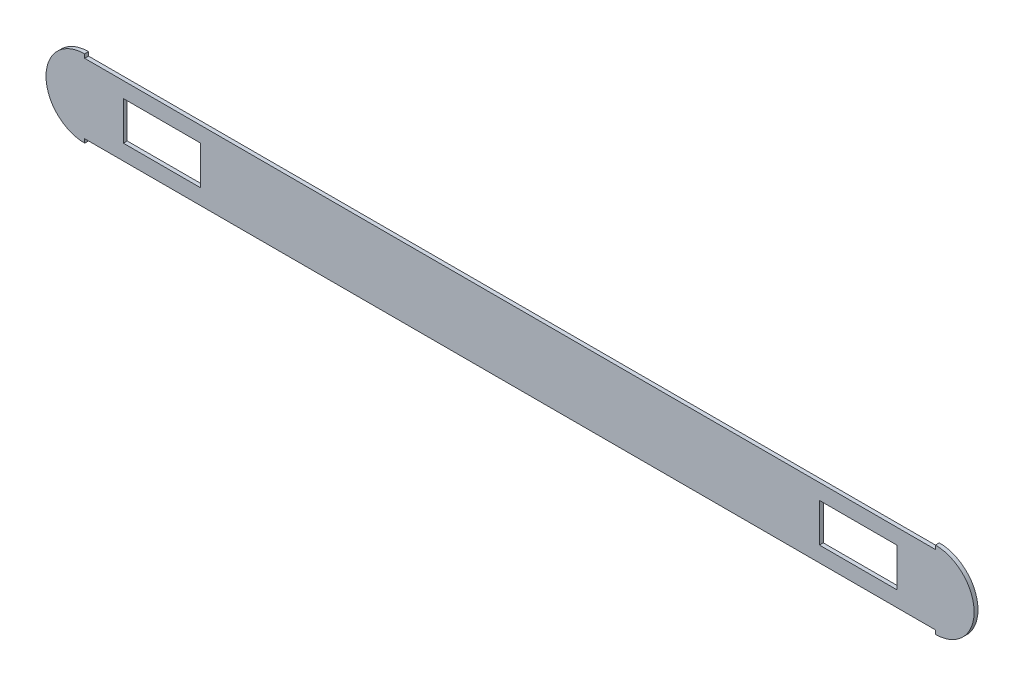
ISO-10303-21;
HEADER;
FILE_DESCRIPTION(('STEP AP214'),'2;1');
FILE_NAME('part.step','',(''),(''),'','','');
FILE_SCHEMA(('AUTOMOTIVE_DESIGN { 1 0 10303 214 1 1 1 1 }'));
ENDSEC;
DATA;
#1=APPLICATION_CONTEXT('core data for automotive mechanical design processes');
#2=APPLICATION_PROTOCOL_DEFINITION('international standard','automotive_design',2000,#1);
#3=PRODUCT_CONTEXT('',#1,'mechanical');
#4=PRODUCT('Part','Part','',(#3));
#5=PRODUCT_RELATED_PRODUCT_CATEGORY('part','',(#4));
#6=PRODUCT_DEFINITION_FORMATION('','',#4);
#7=PRODUCT_DEFINITION_CONTEXT('part definition',#1,'design');
#8=PRODUCT_DEFINITION('design','',#6,#7);
#9=PRODUCT_DEFINITION_SHAPE('','',#8);
#10=(LENGTH_UNIT() NAMED_UNIT(*) SI_UNIT(.MILLI.,.METRE.));
#11=(NAMED_UNIT(*) PLANE_ANGLE_UNIT() SI_UNIT($,.RADIAN.));
#12=(NAMED_UNIT(*) SI_UNIT($,.STERADIAN.) SOLID_ANGLE_UNIT());
#13=UNCERTAINTY_MEASURE_WITH_UNIT(LENGTH_MEASURE(1.E-05),#10,'distance_accuracy_value','');
#14=(GEOMETRIC_REPRESENTATION_CONTEXT(3) GLOBAL_UNCERTAINTY_ASSIGNED_CONTEXT((#13)) GLOBAL_UNIT_ASSIGNED_CONTEXT((#10,
#11,#12)) REPRESENTATION_CONTEXT('',''));
#15=CARTESIAN_POINT('',(0.,0.,0.));
#16=DIRECTION('',(0.,0.,1.));
#17=DIRECTION('',(1.,0.,0.));
#18=AXIS2_PLACEMENT_3D('',#15,#16,#17);
#19=CARTESIAN_POINT('',(597.266258042068,-45.,5.));
#20=DIRECTION('',(0.,0.,1.));
#21=DIRECTION('',(1.,0.,0.));
#22=AXIS2_PLACEMENT_3D('',#19,#20,#21);
#23=PLANE('',#22);
#24=CARTESIAN_POINT('',(-502.733741957931,0.,5.));
#25=DIRECTION('',(0.,0.,1.));
#26=DIRECTION('',(1.,0.,0.));
#27=AXIS2_PLACEMENT_3D('',#24,#25,#26);
#28=CIRCLE('',#27,50.);
#29=CARTESIAN_POINT('',(-502.733741957931,50.,5.));
#30=VERTEX_POINT('',#29);
#31=CARTESIAN_POINT('',(-502.733741957931,-50.,5.));
#32=VERTEX_POINT('',#31);
#33=EDGE_CURVE('E35',#30,#32,#28,.T.);
#34=ORIENTED_EDGE('',*,*,#33,.T.);
#35=DIRECTION('',(0.,1.,0.));
#36=VECTOR('',#35,1.);
#37=CARTESIAN_POINT('',(-502.733741957931,-45.,5.));
#38=LINE('',#37,#36);
#39=CARTESIAN_POINT('',(-502.733741957931,-45.,5.));
#40=VERTEX_POINT('',#39);
#41=EDGE_CURVE('E146',#32,#40,#38,.T.);
#42=ORIENTED_EDGE('',*,*,#41,.T.);
#43=DIRECTION('',(-1.,0.,0.));
#44=VECTOR('',#43,1.);
#45=CARTESIAN_POINT('',(597.266258042068,-45.,5.));
#46=LINE('',#45,#44);
#47=CARTESIAN_POINT('',(597.266258042068,-45.,5.));
#48=VERTEX_POINT('',#47);
#49=EDGE_CURVE('E256',#48,#40,#46,.T.);
#50=ORIENTED_EDGE('',*,*,#49,.F.);
#51=DIRECTION('',(0.,-1.,0.));
#52=VECTOR('',#51,1.);
#53=CARTESIAN_POINT('',(597.266258042068,-45.,5.));
#54=LINE('',#53,#52);
#55=CARTESIAN_POINT('',(597.266258042068,-50.,5.));
#56=VERTEX_POINT('',#55);
#57=EDGE_CURVE('E184',#48,#56,#54,.T.);
#58=ORIENTED_EDGE('',*,*,#57,.T.);
#59=CARTESIAN_POINT('',(597.266258042068,0.,5.));
#60=DIRECTION('',(0.,0.,1.));
#61=DIRECTION('',(1.,0.,0.));
#62=AXIS2_PLACEMENT_3D('',#59,#60,#61);
#63=CIRCLE('',#62,50.);
#64=CARTESIAN_POINT('',(597.266258042068,50.,5.));
#65=VERTEX_POINT('',#64);
#66=EDGE_CURVE('E265',#56,#65,#63,.T.);
#67=ORIENTED_EDGE('',*,*,#66,.T.);
#68=DIRECTION('',(0.,-1.,0.));
#69=VECTOR('',#68,1.);
#70=CARTESIAN_POINT('',(597.266258042068,-45.,5.));
#71=LINE('',#70,#69);
#72=CARTESIAN_POINT('',(597.266258042068,45.,5.));
#73=VERTEX_POINT('',#72);
#74=EDGE_CURVE('E175',#65,#73,#71,.T.);
#75=ORIENTED_EDGE('',*,*,#74,.T.);
#76=DIRECTION('',(1.,0.,0.));
#77=VECTOR('',#76,1.);
#78=CARTESIAN_POINT('',(597.266258042068,45.,5.));
#79=LINE('',#78,#77);
#80=CARTESIAN_POINT('',(-502.733741957931,45.,5.));
#81=VERTEX_POINT('',#80);
#82=EDGE_CURVE('E261',#81,#73,#79,.T.);
#83=ORIENTED_EDGE('',*,*,#82,.F.);
#84=DIRECTION('',(0.,1.,0.));
#85=VECTOR('',#84,1.);
#86=CARTESIAN_POINT('',(-502.733741957931,-45.,5.));
#87=LINE('',#86,#85);
#88=EDGE_CURVE('E149',#81,#30,#87,.T.);
#89=ORIENTED_EDGE('',*,*,#88,.T.);
#90=EDGE_LOOP('',(#34,#42,#50,#58,#67,#75,#83,#89));
#91=FACE_BOUND('',#90,.T.);
#92=DIRECTION('',(0.,-1.,0.));
#93=VECTOR('',#92,1.);
#94=CARTESIAN_POINT('',(-452.733741957932,25.,5.));
#95=LINE('',#94,#93);
#96=CARTESIAN_POINT('',(-452.733741957932,25.,5.));
#97=VERTEX_POINT('',#96);
#98=CARTESIAN_POINT('',(-452.733741957931,-25.,5.));
#99=VERTEX_POINT('',#98);
#100=EDGE_CURVE('E192',#97,#99,#95,.T.);
#101=ORIENTED_EDGE('',*,*,#100,.F.);
#102=DIRECTION('',(-1.,0.,0.));
#103=VECTOR('',#102,1.);
#104=CARTESIAN_POINT('',(-452.733741957932,25.,5.));
#105=LINE('',#104,#103);
#106=CARTESIAN_POINT('',(-352.733741957931,25.,5.));
#107=VERTEX_POINT('',#106);
#108=EDGE_CURVE('E201',#107,#97,#105,.T.);
#109=ORIENTED_EDGE('',*,*,#108,.F.);
#110=DIRECTION('',(0.,1.,0.));
#111=VECTOR('',#110,1.);
#112=CARTESIAN_POINT('',(-352.733741957931,25.,5.));
#113=LINE('',#112,#111);
#114=CARTESIAN_POINT('',(-352.733741957931,-25.,5.));
#115=VERTEX_POINT('',#114);
#116=EDGE_CURVE('E198',#115,#107,#113,.T.);
#117=ORIENTED_EDGE('',*,*,#116,.F.);
#118=DIRECTION('',(1.,0.,0.));
#119=VECTOR('',#118,1.);
#120=CARTESIAN_POINT('',(-452.733741957932,-25.,5.));
#121=LINE('',#120,#119);
#122=EDGE_CURVE('E194',#99,#115,#121,.T.);
#123=ORIENTED_EDGE('',*,*,#122,.F.);
#124=EDGE_LOOP('',(#101,#109,#117,#123));
#125=FACE_BOUND('',#124,.T.);
#126=DIRECTION('',(0.,-1.,0.));
#127=VECTOR('',#126,1.);
#128=CARTESIAN_POINT('',(447.266258042068,25.,5.));
#129=LINE('',#128,#127);
#130=CARTESIAN_POINT('',(447.266258042068,25.,5.));
#131=VERTEX_POINT('',#130);
#132=CARTESIAN_POINT('',(447.266258042068,-25.,5.));
#133=VERTEX_POINT('',#132);
#134=EDGE_CURVE('E183',#131,#133,#129,.T.);
#135=ORIENTED_EDGE('',*,*,#134,.F.);
#136=DIRECTION('',(-1.,0.,0.));
#137=VECTOR('',#136,1.);
#138=CARTESIAN_POINT('',(447.266258042068,25.,5.));
#139=LINE('',#138,#137);
#140=CARTESIAN_POINT('',(547.266258042068,25.,5.));
#141=VERTEX_POINT('',#140);
#142=EDGE_CURVE('E221',#141,#131,#139,.T.);
#143=ORIENTED_EDGE('',*,*,#142,.F.);
#144=DIRECTION('',(0.,1.,0.));
#145=VECTOR('',#144,1.);
#146=CARTESIAN_POINT('',(547.266258042068,25.,5.));
#147=LINE('',#146,#145);
#148=CARTESIAN_POINT('',(547.266258042068,-25.,5.));
#149=VERTEX_POINT('',#148);
#150=EDGE_CURVE('E218',#149,#141,#147,.T.);
#151=ORIENTED_EDGE('',*,*,#150,.F.);
#152=DIRECTION('',(1.,0.,0.));
#153=VECTOR('',#152,1.);
#154=CARTESIAN_POINT('',(447.266258042068,-25.,5.));
#155=LINE('',#154,#153);
#156=EDGE_CURVE('E215',#133,#149,#155,.T.);
#157=ORIENTED_EDGE('',*,*,#156,.F.);
#158=EDGE_LOOP('',(#135,#143,#151,#157));
#159=FACE_BOUND('',#158,.T.);
#160=ADVANCED_FACE('F32',(#91,#125,#159),#23,.T.);
#161=CARTESIAN_POINT('',(-502.733741957931,0.,80.));
#162=DIRECTION('',(0.,0.,-1.));
#163=DIRECTION('',(-1.,0.,0.));
#164=AXIS2_PLACEMENT_3D('',#161,#162,#163);
#165=CYLINDRICAL_SURFACE('',#164,50.);
#166=CARTESIAN_POINT('',(-502.733741957931,0.,0.));
#167=DIRECTION('',(0.,0.,1.));
#168=DIRECTION('',(1.,0.,0.));
#169=AXIS2_PLACEMENT_3D('',#166,#167,#168);
#170=CIRCLE('',#169,50.);
#171=CARTESIAN_POINT('',(-502.733741957931,50.,0.));
#172=VERTEX_POINT('',#171);
#173=CARTESIAN_POINT('',(-502.733741957931,-50.,0.));
#174=VERTEX_POINT('',#173);
#175=EDGE_CURVE('E52',#172,#174,#170,.T.);
#176=ORIENTED_EDGE('',*,*,#175,.T.);
#177=DIRECTION('',(0.,0.,-1.));
#178=VECTOR('',#177,1.);
#179=CARTESIAN_POINT('',(-502.733741957931,-50.,80.));
#180=LINE('',#179,#178);
#181=EDGE_CURVE('E156',#32,#174,#180,.T.);
#182=ORIENTED_EDGE('',*,*,#181,.F.);
#183=ORIENTED_EDGE('',*,*,#33,.F.);
#184=DIRECTION('',(0.,0.,-1.));
#185=VECTOR('',#184,1.);
#186=CARTESIAN_POINT('',(-502.733741957931,50.,80.));
#187=LINE('',#186,#185);
#188=EDGE_CURVE('E268',#30,#172,#187,.T.);
#189=ORIENTED_EDGE('',*,*,#188,.T.);
#190=EDGE_LOOP('',(#176,#182,#183,#189));
#191=FACE_BOUND('',#190,.T.);
#192=ADVANCED_FACE('F162',(#191),#165,.T.);
#193=CARTESIAN_POINT('',(-502.733741957931,0.,0.));
#194=DIRECTION('',(0.,0.,1.));
#195=DIRECTION('',(1.,0.,0.));
#196=AXIS2_PLACEMENT_3D('',#193,#194,#195);
#197=PLANE('',#196);
#198=DIRECTION('',(0.,1.,0.));
#199=VECTOR('',#198,1.);
#200=CARTESIAN_POINT('',(-502.733741957931,0.,0.));
#201=LINE('',#200,#199);
#202=CARTESIAN_POINT('',(-502.733741957931,45.,0.));
#203=VERTEX_POINT('',#202);
#204=EDGE_CURVE('E47',#203,#172,#201,.T.);
#205=ORIENTED_EDGE('',*,*,#204,.F.);
#206=DIRECTION('',(1.,0.,0.));
#207=VECTOR('',#206,1.);
#208=CARTESIAN_POINT('',(-502.733741957931,45.,0.));
#209=LINE('',#208,#207);
#210=CARTESIAN_POINT('',(597.266258042068,45.,0.));
#211=VERTEX_POINT('',#210);
#212=EDGE_CURVE('E258',#203,#211,#209,.T.);
#213=ORIENTED_EDGE('',*,*,#212,.T.);
#214=DIRECTION('',(0.,-1.,0.));
#215=VECTOR('',#214,1.);
#216=CARTESIAN_POINT('',(597.266258042068,0.,0.));
#217=LINE('',#216,#215);
#218=CARTESIAN_POINT('',(597.266258042068,50.,0.));
#219=VERTEX_POINT('',#218);
#220=EDGE_CURVE('E172',#219,#211,#217,.T.);
#221=ORIENTED_EDGE('',*,*,#220,.F.);
#222=CARTESIAN_POINT('',(597.266258042068,0.,0.));
#223=DIRECTION('',(0.,0.,1.));
#224=DIRECTION('',(1.,0.,0.));
#225=AXIS2_PLACEMENT_3D('',#222,#223,#224);
#226=CIRCLE('',#225,50.);
#227=CARTESIAN_POINT('',(597.266258042068,-50.,0.));
#228=VERTEX_POINT('',#227);
#229=EDGE_CURVE('E263',#228,#219,#226,.T.);
#230=ORIENTED_EDGE('',*,*,#229,.F.);
#231=DIRECTION('',(0.,-1.,0.));
#232=VECTOR('',#231,1.);
#233=CARTESIAN_POINT('',(597.266258042068,0.,0.));
#234=LINE('',#233,#232);
#235=CARTESIAN_POINT('',(597.266258042068,-45.,0.));
#236=VERTEX_POINT('',#235);
#237=EDGE_CURVE('E187',#236,#228,#234,.T.);
#238=ORIENTED_EDGE('',*,*,#237,.F.);
#239=DIRECTION('',(-1.,0.,0.));
#240=VECTOR('',#239,1.);
#241=CARTESIAN_POINT('',(-502.733741957931,-45.,0.));
#242=LINE('',#241,#240);
#243=CARTESIAN_POINT('',(-502.733741957931,-45.,0.));
#244=VERTEX_POINT('',#243);
#245=EDGE_CURVE('E255',#236,#244,#242,.T.);
#246=ORIENTED_EDGE('',*,*,#245,.T.);
#247=DIRECTION('',(0.,1.,0.));
#248=VECTOR('',#247,1.);
#249=CARTESIAN_POINT('',(-502.733741957931,0.,0.));
#250=LINE('',#249,#248);
#251=EDGE_CURVE('E160',#174,#244,#250,.T.);
#252=ORIENTED_EDGE('',*,*,#251,.F.);
#253=ORIENTED_EDGE('',*,*,#175,.F.);
#254=EDGE_LOOP('',(#205,#213,#221,#230,#238,#246,#252,#253));
#255=FACE_BOUND('',#254,.T.);
#256=DIRECTION('',(-1.,0.,0.));
#257=VECTOR('',#256,1.);
#258=CARTESIAN_POINT('',(-502.733741957931,25.,0.));
#259=LINE('',#258,#257);
#260=CARTESIAN_POINT('',(-352.733741957931,25.,0.));
#261=VERTEX_POINT('',#260);
#262=CARTESIAN_POINT('',(-452.733741957932,25.,0.));
#263=VERTEX_POINT('',#262);
#264=EDGE_CURVE('E249',#261,#263,#259,.T.);
#265=ORIENTED_EDGE('',*,*,#264,.T.);
#266=DIRECTION('',(0.,-1.,0.));
#267=VECTOR('',#266,1.);
#268=CARTESIAN_POINT('',(-452.733741957932,0.,0.));
#269=LINE('',#268,#267);
#270=CARTESIAN_POINT('',(-452.733741957932,-25.,0.));
#271=VERTEX_POINT('',#270);
#272=EDGE_CURVE('E252',#263,#271,#269,.T.);
#273=ORIENTED_EDGE('',*,*,#272,.T.);
#274=DIRECTION('',(1.,0.,0.));
#275=VECTOR('',#274,1.);
#276=CARTESIAN_POINT('',(-502.733741957931,-25.,0.));
#277=LINE('',#276,#275);
#278=CARTESIAN_POINT('',(-352.733741957931,-25.,0.));
#279=VERTEX_POINT('',#278);
#280=EDGE_CURVE('E243',#271,#279,#277,.T.);
#281=ORIENTED_EDGE('',*,*,#280,.T.);
#282=DIRECTION('',(0.,1.,0.));
#283=VECTOR('',#282,1.);
#284=CARTESIAN_POINT('',(-352.733741957931,0.,0.));
#285=LINE('',#284,#283);
#286=EDGE_CURVE('E246',#279,#261,#285,.T.);
#287=ORIENTED_EDGE('',*,*,#286,.T.);
#288=EDGE_LOOP('',(#265,#273,#281,#287));
#289=FACE_BOUND('',#288,.T.);
#290=DIRECTION('',(-1.,0.,0.));
#291=VECTOR('',#290,1.);
#292=CARTESIAN_POINT('',(-502.733741957931,25.0000000000004,0.));
#293=LINE('',#292,#291);
#294=CARTESIAN_POINT('',(547.266258042068,25.,0.));
#295=VERTEX_POINT('',#294);
#296=CARTESIAN_POINT('',(447.266258042068,25.,0.));
#297=VERTEX_POINT('',#296);
#298=EDGE_CURVE('E237',#295,#297,#293,.T.);
#299=ORIENTED_EDGE('',*,*,#298,.T.);
#300=DIRECTION('',(0.,-1.,0.));
#301=VECTOR('',#300,1.);
#302=CARTESIAN_POINT('',(447.266258042068,0.,0.));
#303=LINE('',#302,#301);
#304=CARTESIAN_POINT('',(447.266258042068,-25.,0.));
#305=VERTEX_POINT('',#304);
#306=EDGE_CURVE('E240',#297,#305,#303,.T.);
#307=ORIENTED_EDGE('',*,*,#306,.T.);
#308=DIRECTION('',(1.,0.,0.));
#309=VECTOR('',#308,1.);
#310=CARTESIAN_POINT('',(-502.733741957931,-25.,0.));
#311=LINE('',#310,#309);
#312=CARTESIAN_POINT('',(547.266258042068,-25.,0.));
#313=VERTEX_POINT('',#312);
#314=EDGE_CURVE('E207',#305,#313,#311,.T.);
#315=ORIENTED_EDGE('',*,*,#314,.T.);
#316=DIRECTION('',(0.,1.,0.));
#317=VECTOR('',#316,1.);
#318=CARTESIAN_POINT('',(547.266258042068,0.,0.));
#319=LINE('',#318,#317);
#320=EDGE_CURVE('E234',#313,#295,#319,.T.);
#321=ORIENTED_EDGE('',*,*,#320,.T.);
#322=EDGE_LOOP('',(#299,#307,#315,#321));
#323=FACE_BOUND('',#322,.T.);
#324=ADVANCED_FACE('F278',(#255,#289,#323),#197,.F.);
#325=CARTESIAN_POINT('',(-502.733741957931,0.,0.));
#326=DIRECTION('',(1.,0.,0.));
#327=DIRECTION('',(0.,0.,-1.));
#328=AXIS2_PLACEMENT_3D('',#325,#326,#327);
#329=PLANE('',#328);
#330=DIRECTION('',(0.,0.,1.));
#331=VECTOR('',#330,1.);
#332=CARTESIAN_POINT('',(-502.733741957931,45.,0.));
#333=LINE('',#332,#331);
#334=EDGE_CURVE('E11',#203,#81,#333,.T.);
#335=ORIENTED_EDGE('',*,*,#334,.F.);
#336=ORIENTED_EDGE('',*,*,#204,.T.);
#337=ORIENTED_EDGE('',*,*,#188,.F.);
#338=ORIENTED_EDGE('',*,*,#88,.F.);
#339=EDGE_LOOP('',(#335,#336,#337,#338));
#340=FACE_BOUND('',#339,.T.);
#341=ADVANCED_FACE('F272',(#340),#329,.T.);
#342=CARTESIAN_POINT('',(0.,45.,0.));
#343=DIRECTION('',(0.,-1.,0.));
#344=DIRECTION('',(0.,0.,-1.));
#345=AXIS2_PLACEMENT_3D('',#342,#343,#344);
#346=PLANE('',#345);
#347=ORIENTED_EDGE('',*,*,#212,.F.);
#348=ORIENTED_EDGE('',*,*,#334,.T.);
#349=ORIENTED_EDGE('',*,*,#82,.T.);
#350=DIRECTION('',(0.,0.,-1.));
#351=VECTOR('',#350,1.);
#352=CARTESIAN_POINT('',(597.266258042068,45.,0.));
#353=LINE('',#352,#351);
#354=EDGE_CURVE('E164',#73,#211,#353,.T.);
#355=ORIENTED_EDGE('',*,*,#354,.T.);
#356=EDGE_LOOP('',(#347,#348,#349,#355));
#357=FACE_BOUND('',#356,.T.);
#358=ADVANCED_FACE('F275',(#357),#346,.F.);
#359=CARTESIAN_POINT('',(0.,-45.,0.));
#360=DIRECTION('',(0.,1.,0.));
#361=DIRECTION('',(0.,0.,1.));
#362=AXIS2_PLACEMENT_3D('',#359,#360,#361);
#363=PLANE('',#362);
#364=ORIENTED_EDGE('',*,*,#49,.T.);
#365=DIRECTION('',(0.,0.,-1.));
#366=VECTOR('',#365,1.);
#367=CARTESIAN_POINT('',(-502.733741957931,-45.,0.));
#368=LINE('',#367,#366);
#369=EDGE_CURVE('E158',#40,#244,#368,.T.);
#370=ORIENTED_EDGE('',*,*,#369,.T.);
#371=ORIENTED_EDGE('',*,*,#245,.F.);
#372=DIRECTION('',(0.,0.,1.));
#373=VECTOR('',#372,1.);
#374=CARTESIAN_POINT('',(597.266258042068,-45.,0.));
#375=LINE('',#374,#373);
#376=EDGE_CURVE('E171',#236,#48,#375,.T.);
#377=ORIENTED_EDGE('',*,*,#376,.T.);
#378=EDGE_LOOP('',(#364,#370,#371,#377));
#379=FACE_BOUND('',#378,.T.);
#380=ADVANCED_FACE('F292',(#379),#363,.F.);
#381=CARTESIAN_POINT('',(447.266258042068,-25.,-5.));
#382=DIRECTION('',(0.,-1.,0.));
#383=DIRECTION('',(0.,0.,-1.));
#384=AXIS2_PLACEMENT_3D('',#381,#382,#383);
#385=PLANE('',#384);
#386=DIRECTION('',(0.,0.,1.));
#387=VECTOR('',#386,1.);
#388=CARTESIAN_POINT('',(447.266258042068,-25.,-5.));
#389=LINE('',#388,#387);
#390=EDGE_CURVE('E224',#305,#133,#389,.T.);
#391=ORIENTED_EDGE('',*,*,#390,.T.);
#392=ORIENTED_EDGE('',*,*,#156,.T.);
#393=DIRECTION('',(0.,0.,1.));
#394=VECTOR('',#393,1.);
#395=CARTESIAN_POINT('',(547.266258042068,-25.,-5.));
#396=LINE('',#395,#394);
#397=EDGE_CURVE('E228',#313,#149,#396,.T.);
#398=ORIENTED_EDGE('',*,*,#397,.F.);
#399=ORIENTED_EDGE('',*,*,#314,.F.);
#400=EDGE_LOOP('',(#391,#392,#398,#399));
#401=FACE_BOUND('',#400,.T.);
#402=ADVANCED_FACE('F294',(#401),#385,.F.);
#403=CARTESIAN_POINT('',(547.266258042068,25.,-5.));
#404=DIRECTION('',(1.,0.,0.));
#405=DIRECTION('',(0.,0.,-1.));
#406=AXIS2_PLACEMENT_3D('',#403,#404,#405);
#407=PLANE('',#406);
#408=ORIENTED_EDGE('',*,*,#397,.T.);
#409=ORIENTED_EDGE('',*,*,#150,.T.);
#410=DIRECTION('',(0.,0.,1.));
#411=VECTOR('',#410,1.);
#412=CARTESIAN_POINT('',(547.266258042068,25.,-5.));
#413=LINE('',#412,#411);
#414=EDGE_CURVE('E226',#295,#141,#413,.T.);
#415=ORIENTED_EDGE('',*,*,#414,.F.);
#416=ORIENTED_EDGE('',*,*,#320,.F.);
#417=EDGE_LOOP('',(#408,#409,#415,#416));
#418=FACE_BOUND('',#417,.T.);
#419=ADVANCED_FACE('F300',(#418),#407,.F.);
#420=CARTESIAN_POINT('',(447.266258042068,25.,-5.));
#421=DIRECTION('',(0.,1.,0.));
#422=DIRECTION('',(-1.,0.,0.));
#423=AXIS2_PLACEMENT_3D('',#420,#421,#422);
#424=PLANE('',#423);
#425=ORIENTED_EDGE('',*,*,#414,.T.);
#426=ORIENTED_EDGE('',*,*,#142,.T.);
#427=DIRECTION('',(0.,0.,1.));
#428=VECTOR('',#427,1.);
#429=CARTESIAN_POINT('',(447.266258042068,25.,-5.));
#430=LINE('',#429,#428);
#431=EDGE_CURVE('E195',#297,#131,#430,.T.);
#432=ORIENTED_EDGE('',*,*,#431,.F.);
#433=ORIENTED_EDGE('',*,*,#298,.F.);
#434=EDGE_LOOP('',(#425,#426,#432,#433));
#435=FACE_BOUND('',#434,.T.);
#436=ADVANCED_FACE('F375',(#435),#424,.F.);
#437=CARTESIAN_POINT('',(447.266258042068,25.,-5.));
#438=DIRECTION('',(-1.,0.,0.));
#439=DIRECTION('',(0.,0.,1.));
#440=AXIS2_PLACEMENT_3D('',#437,#438,#439);
#441=PLANE('',#440);
#442=ORIENTED_EDGE('',*,*,#431,.T.);
#443=ORIENTED_EDGE('',*,*,#134,.T.);
#444=ORIENTED_EDGE('',*,*,#390,.F.);
#445=ORIENTED_EDGE('',*,*,#306,.F.);
#446=EDGE_LOOP('',(#442,#443,#444,#445));
#447=FACE_BOUND('',#446,.T.);
#448=ADVANCED_FACE('F386',(#447),#441,.F.);
#449=CARTESIAN_POINT('',(-452.733741957932,-25.,-5.));
#450=DIRECTION('',(0.,-1.,0.));
#451=DIRECTION('',(0.,0.,-1.));
#452=AXIS2_PLACEMENT_3D('',#449,#450,#451);
#453=PLANE('',#452);
#454=DIRECTION('',(0.,0.,1.));
#455=VECTOR('',#454,1.);
#456=CARTESIAN_POINT('',(-452.733741957932,-25.,-5.));
#457=LINE('',#456,#455);
#458=EDGE_CURVE('E204',#271,#99,#457,.T.);
#459=ORIENTED_EDGE('',*,*,#458,.T.);
#460=ORIENTED_EDGE('',*,*,#122,.T.);
#461=DIRECTION('',(0.,0.,1.));
#462=VECTOR('',#461,1.);
#463=CARTESIAN_POINT('',(-352.733741957931,-25.,-5.));
#464=LINE('',#463,#462);
#465=EDGE_CURVE('E210',#279,#115,#464,.T.);
#466=ORIENTED_EDGE('',*,*,#465,.F.);
#467=ORIENTED_EDGE('',*,*,#280,.F.);
#468=EDGE_LOOP('',(#459,#460,#466,#467));
#469=FACE_BOUND('',#468,.T.);
#470=ADVANCED_FACE('F396',(#469),#453,.F.);
#471=CARTESIAN_POINT('',(-352.733741957931,25.,-5.));
#472=DIRECTION('',(1.,0.,0.));
#473=DIRECTION('',(0.,0.,-1.));
#474=AXIS2_PLACEMENT_3D('',#471,#472,#473);
#475=PLANE('',#474);
#476=ORIENTED_EDGE('',*,*,#465,.T.);
#477=ORIENTED_EDGE('',*,*,#116,.T.);
#478=DIRECTION('',(0.,0.,1.));
#479=VECTOR('',#478,1.);
#480=CARTESIAN_POINT('',(-352.733741957931,25.,-5.));
#481=LINE('',#480,#479);
#482=EDGE_CURVE('E208',#261,#107,#481,.T.);
#483=ORIENTED_EDGE('',*,*,#482,.F.);
#484=ORIENTED_EDGE('',*,*,#286,.F.);
#485=EDGE_LOOP('',(#476,#477,#483,#484));
#486=FACE_BOUND('',#485,.T.);
#487=ADVANCED_FACE('F406',(#486),#475,.F.);
#488=CARTESIAN_POINT('',(-452.733741957932,25.,-5.));
#489=DIRECTION('',(0.,1.,0.));
#490=DIRECTION('',(0.,0.,1.));
#491=AXIS2_PLACEMENT_3D('',#488,#489,#490);
#492=PLANE('',#491);
#493=ORIENTED_EDGE('',*,*,#482,.T.);
#494=ORIENTED_EDGE('',*,*,#108,.T.);
#495=DIRECTION('',(0.,0.,1.));
#496=VECTOR('',#495,1.);
#497=CARTESIAN_POINT('',(-452.733741957932,25.,-5.));
#498=LINE('',#497,#496);
#499=EDGE_CURVE('E205',#263,#97,#498,.T.);
#500=ORIENTED_EDGE('',*,*,#499,.F.);
#501=ORIENTED_EDGE('',*,*,#264,.F.);
#502=EDGE_LOOP('',(#493,#494,#500,#501));
#503=FACE_BOUND('',#502,.T.);
#504=ADVANCED_FACE('F416',(#503),#492,.F.);
#505=CARTESIAN_POINT('',(-452.733741957932,25.,-5.));
#506=DIRECTION('',(-1.,0.,0.));
#507=DIRECTION('',(0.,0.,1.));
#508=AXIS2_PLACEMENT_3D('',#505,#506,#507);
#509=PLANE('',#508);
#510=ORIENTED_EDGE('',*,*,#499,.T.);
#511=ORIENTED_EDGE('',*,*,#100,.T.);
#512=ORIENTED_EDGE('',*,*,#458,.F.);
#513=ORIENTED_EDGE('',*,*,#272,.F.);
#514=EDGE_LOOP('',(#510,#511,#512,#513));
#515=FACE_BOUND('',#514,.T.);
#516=ADVANCED_FACE('F307',(#515),#509,.F.);
#517=CARTESIAN_POINT('',(597.266258042068,0.,80.));
#518=DIRECTION('',(0.,0.,-1.));
#519=DIRECTION('',(-1.,0.,0.));
#520=AXIS2_PLACEMENT_3D('',#517,#518,#519);
#521=CYLINDRICAL_SURFACE('',#520,50.);
#522=ORIENTED_EDGE('',*,*,#66,.F.);
#523=DIRECTION('',(0.,0.,-1.));
#524=VECTOR('',#523,1.);
#525=CARTESIAN_POINT('',(597.266258042068,-50.,80.));
#526=LINE('',#525,#524);
#527=EDGE_CURVE('E180',#56,#228,#526,.T.);
#528=ORIENTED_EDGE('',*,*,#527,.T.);
#529=ORIENTED_EDGE('',*,*,#229,.T.);
#530=DIRECTION('',(0.,0.,-1.));
#531=VECTOR('',#530,1.);
#532=CARTESIAN_POINT('',(597.266258042068,50.,80.));
#533=LINE('',#532,#531);
#534=EDGE_CURVE('E168',#65,#219,#533,.T.);
#535=ORIENTED_EDGE('',*,*,#534,.F.);
#536=EDGE_LOOP('',(#522,#528,#529,#535));
#537=FACE_BOUND('',#536,.T.);
#538=ADVANCED_FACE('F285',(#537),#521,.T.);
#539=CARTESIAN_POINT('',(597.266258042068,0.,0.));
#540=DIRECTION('',(-1.,0.,0.));
#541=DIRECTION('',(0.,0.,1.));
#542=AXIS2_PLACEMENT_3D('',#539,#540,#541);
#543=PLANE('',#542);
#544=ORIENTED_EDGE('',*,*,#376,.F.);
#545=ORIENTED_EDGE('',*,*,#237,.T.);
#546=ORIENTED_EDGE('',*,*,#527,.F.);
#547=ORIENTED_EDGE('',*,*,#57,.F.);
#548=EDGE_LOOP('',(#544,#545,#546,#547));
#549=FACE_BOUND('',#548,.T.);
#550=ADVANCED_FACE('F290',(#549),#543,.T.);
#551=CARTESIAN_POINT('',(597.266258042068,0.,0.));
#552=DIRECTION('',(-1.,0.,0.));
#553=DIRECTION('',(0.,0.,1.));
#554=AXIS2_PLACEMENT_3D('',#551,#552,#553);
#555=PLANE('',#554);
#556=ORIENTED_EDGE('',*,*,#534,.T.);
#557=ORIENTED_EDGE('',*,*,#220,.T.);
#558=ORIENTED_EDGE('',*,*,#354,.F.);
#559=ORIENTED_EDGE('',*,*,#74,.F.);
#560=EDGE_LOOP('',(#556,#557,#558,#559));
#561=FACE_BOUND('',#560,.T.);
#562=ADVANCED_FACE('F281',(#561),#555,.T.);
#563=CARTESIAN_POINT('',(-502.733741957931,0.,0.));
#564=DIRECTION('',(1.,0.,0.));
#565=DIRECTION('',(0.,0.,-1.));
#566=AXIS2_PLACEMENT_3D('',#563,#564,#565);
#567=PLANE('',#566);
#568=ORIENTED_EDGE('',*,*,#181,.T.);
#569=ORIENTED_EDGE('',*,*,#251,.T.);
#570=ORIENTED_EDGE('',*,*,#369,.F.);
#571=ORIENTED_EDGE('',*,*,#41,.F.);
#572=EDGE_LOOP('',(#568,#569,#570,#571));
#573=FACE_BOUND('',#572,.T.);
#574=ADVANCED_FACE('F155',(#573),#567,.T.);
#575=CLOSED_SHELL('',(#160,#192,#324,#341,#358,#380,#402,#419,#436,#448,#470,#487,#504,#516,
#538,#550,#562,#574));
#576=MANIFOLD_SOLID_BREP('B2',#575);
#577=ADVANCED_BREP_SHAPE_REPRESENTATION('',(#18,#576),#14);
#578=SHAPE_DEFINITION_REPRESENTATION(#9,#577);
ENDSEC;
END-ISO-10303-21;
